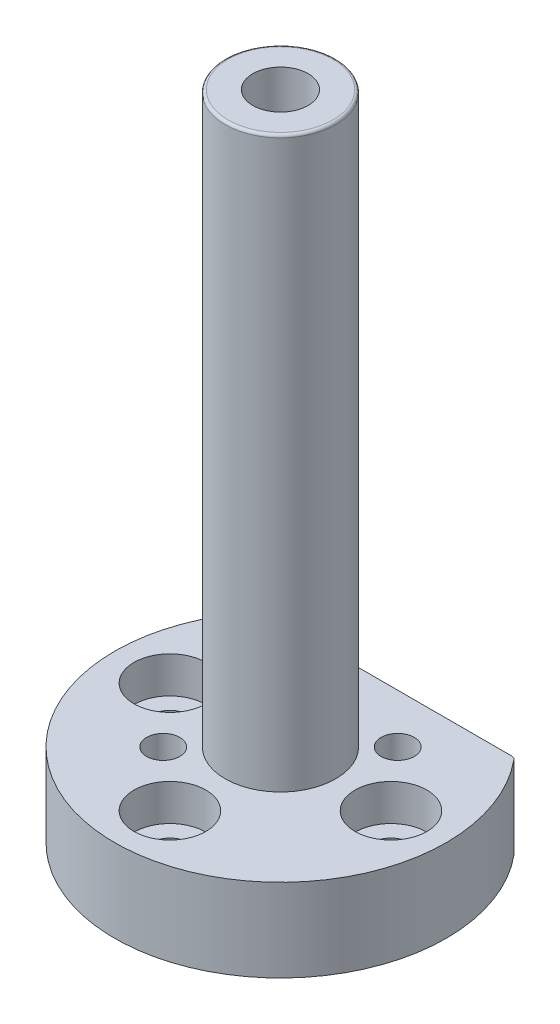
ISO-10303-21;
HEADER;
FILE_DESCRIPTION(('STEP AP214'),'2;1');
FILE_NAME('part.step','',(''),(''),'','','');
FILE_SCHEMA(('AUTOMOTIVE_DESIGN { 1 0 10303 214 1 1 1 1 }'));
ENDSEC;
DATA;
#1=APPLICATION_CONTEXT('core data for automotive mechanical design processes');
#2=APPLICATION_PROTOCOL_DEFINITION('international standard','automotive_design',2000,#1);
#3=PRODUCT_CONTEXT('',#1,'mechanical');
#4=PRODUCT('Part','Part','',(#3));
#5=PRODUCT_RELATED_PRODUCT_CATEGORY('part','',(#4));
#6=PRODUCT_DEFINITION_FORMATION('','',#4);
#7=PRODUCT_DEFINITION_CONTEXT('part definition',#1,'design');
#8=PRODUCT_DEFINITION('design','',#6,#7);
#9=PRODUCT_DEFINITION_SHAPE('','',#8);
#10=(LENGTH_UNIT() NAMED_UNIT(*) SI_UNIT(.MILLI.,.METRE.));
#11=(NAMED_UNIT(*) PLANE_ANGLE_UNIT() SI_UNIT($,.RADIAN.));
#12=(NAMED_UNIT(*) SI_UNIT($,.STERADIAN.) SOLID_ANGLE_UNIT());
#13=UNCERTAINTY_MEASURE_WITH_UNIT(LENGTH_MEASURE(1.E-05),#10,'distance_accuracy_value','');
#14=(GEOMETRIC_REPRESENTATION_CONTEXT(3) GLOBAL_UNCERTAINTY_ASSIGNED_CONTEXT((#13)) GLOBAL_UNIT_ASSIGNED_CONTEXT((#10,
#11,#12)) REPRESENTATION_CONTEXT('',''));
#15=CARTESIAN_POINT('',(0.,0.,0.));
#16=DIRECTION('',(0.,0.,1.));
#17=DIRECTION('',(1.,0.,0.));
#18=AXIS2_PLACEMENT_3D('',#15,#16,#17);
#19=CARTESIAN_POINT('',(0.,15.,0.));
#20=DIRECTION('',(0.,-1.,0.));
#21=DIRECTION('',(0.,0.,-1.));
#22=AXIS2_PLACEMENT_3D('',#19,#20,#21);
#23=CYLINDRICAL_SURFACE('',#22,30.);
#24=CARTESIAN_POINT('',(0.,15.,0.));
#25=DIRECTION('',(0.,1.,0.));
#26=DIRECTION('',(0.,0.,1.));
#27=AXIS2_PLACEMENT_3D('',#24,#25,#26);
#28=CIRCLE('',#27,30.);
#29=CARTESIAN_POINT('',(-23.1028049318558,15.,-19.1379310344828));
#30=VERTEX_POINT('',#29);
#31=CARTESIAN_POINT('',(23.1028049318558,15.,-19.1379310344828));
#32=VERTEX_POINT('',#31);
#33=EDGE_CURVE('E97',#30,#32,#28,.T.);
#34=ORIENTED_EDGE('',*,*,#33,.F.);
#35=DIRECTION('',(0.,-1.,0.));
#36=VECTOR('',#35,1.);
#37=CARTESIAN_POINT('',(-23.1028049318558,15.,-19.1379310344828));
#38=LINE('',#37,#36);
#39=CARTESIAN_POINT('',(-23.1028049318558,0.,-19.1379310344828));
#40=VERTEX_POINT('',#39);
#41=EDGE_CURVE('E84',#30,#40,#38,.T.);
#42=ORIENTED_EDGE('',*,*,#41,.T.);
#43=CARTESIAN_POINT('',(0.,0.,0.));
#44=DIRECTION('',(0.,1.,0.));
#45=DIRECTION('',(0.,0.,1.));
#46=AXIS2_PLACEMENT_3D('',#43,#44,#45);
#47=CIRCLE('',#46,30.);
#48=CARTESIAN_POINT('',(23.1028049318558,0.,-19.1379310344828));
#49=VERTEX_POINT('',#48);
#50=EDGE_CURVE('E95',#40,#49,#47,.T.);
#51=ORIENTED_EDGE('',*,*,#50,.T.);
#52=DIRECTION('',(0.,-1.,0.));
#53=VECTOR('',#52,1.);
#54=CARTESIAN_POINT('',(23.1028049318558,15.,-19.1379310344828));
#55=LINE('',#54,#53);
#56=EDGE_CURVE('E99',#49,#32,#55,.F.);
#57=ORIENTED_EDGE('',*,*,#56,.T.);
#58=EDGE_LOOP('',(#34,#42,#51,#57));
#59=FACE_BOUND('',#58,.T.);
#60=ADVANCED_FACE('F39',(#59),#23,.T.);
#61=CARTESIAN_POINT('',(22.798026230356,15.,-19.5));
#62=DIRECTION('',(0.,0.,1.));
#63=DIRECTION('',(1.,0.,0.));
#64=AXIS2_PLACEMENT_3D('',#61,#62,#63);
#65=PLANE('',#64);
#66=DIRECTION('',(-1.,0.,0.));
#67=VECTOR('',#66,1.);
#68=CARTESIAN_POINT('',(22.798026230356,0.,-19.5));
#69=LINE('',#68,#67);
#70=CARTESIAN_POINT('',(22.3327114341273,0.,-19.5));
#71=VERTEX_POINT('',#70);
#72=CARTESIAN_POINT('',(-22.3327114341273,0.,-19.5));
#73=VERTEX_POINT('',#72);
#74=EDGE_CURVE('E103',#71,#73,#69,.T.);
#75=ORIENTED_EDGE('',*,*,#74,.T.);
#76=DIRECTION('',(0.,-1.,0.));
#77=VECTOR('',#76,1.);
#78=CARTESIAN_POINT('',(-22.3327114341273,15.,-19.5));
#79=LINE('',#78,#77);
#80=CARTESIAN_POINT('',(-22.3327114341273,15.,-19.5));
#81=VERTEX_POINT('',#80);
#82=EDGE_CURVE('E55',#73,#81,#79,.F.);
#83=ORIENTED_EDGE('',*,*,#82,.T.);
#84=DIRECTION('',(-1.,0.,0.));
#85=VECTOR('',#84,1.);
#86=CARTESIAN_POINT('',(22.798026230356,15.,-19.5));
#87=LINE('',#86,#85);
#88=CARTESIAN_POINT('',(22.3327114341273,15.,-19.5));
#89=VERTEX_POINT('',#88);
#90=EDGE_CURVE('E113',#89,#81,#87,.T.);
#91=ORIENTED_EDGE('',*,*,#90,.F.);
#92=DIRECTION('',(0.,-1.,0.));
#93=VECTOR('',#92,1.);
#94=CARTESIAN_POINT('',(22.3327114341273,15.,-19.5));
#95=LINE('',#94,#93);
#96=EDGE_CURVE('E89',#89,#71,#95,.T.);
#97=ORIENTED_EDGE('',*,*,#96,.T.);
#98=EDGE_LOOP('',(#75,#83,#91,#97));
#99=FACE_BOUND('',#98,.T.);
#100=ADVANCED_FACE('F228',(#99),#65,.F.);
#101=CARTESIAN_POINT('',(0.,15.,0.));
#102=DIRECTION('',(0.,1.,0.));
#103=DIRECTION('',(0.,0.,1.));
#104=AXIS2_PLACEMENT_3D('',#101,#102,#103);
#105=PLANE('',#104);
#106=CARTESIAN_POINT('',(-10.6066017177983,15.,10.6066017177982));
#107=DIRECTION('',(0.,1.,0.));
#108=DIRECTION('',(0.,0.,1.));
#109=AXIS2_PLACEMENT_3D('',#106,#107,#108);
#110=CIRCLE('',#109,3.);
#111=CARTESIAN_POINT('',(-10.6066017177983,15.,13.6066017177982));
#112=VERTEX_POINT('',#111);
#113=EDGE_CURVE('E208',#112,#112,#110,.T.);
#114=ORIENTED_EDGE('',*,*,#113,.F.);
#115=EDGE_LOOP('',(#114));
#116=FACE_BOUND('',#115,.T.);
#117=CARTESIAN_POINT('',(10.6066017177983,15.,-10.6066017177982));
#118=DIRECTION('',(0.,1.,0.));
#119=DIRECTION('',(0.,0.,1.));
#120=AXIS2_PLACEMENT_3D('',#117,#118,#119);
#121=CIRCLE('',#120,3.);
#122=CARTESIAN_POINT('',(10.6066017177983,15.,-7.60660171779815));
#123=VERTEX_POINT('',#122);
#124=EDGE_CURVE('E200',#123,#123,#121,.T.);
#125=ORIENTED_EDGE('',*,*,#124,.F.);
#126=EDGE_LOOP('',(#125));
#127=FACE_BOUND('',#126,.T.);
#128=CARTESIAN_POINT('',(-20.,15.,0.));
#129=DIRECTION('',(0.,1.,0.));
#130=DIRECTION('',(-1.,0.,0.));
#131=AXIS2_PLACEMENT_3D('',#128,#129,#130);
#132=CIRCLE('',#131,6.5);
#133=CARTESIAN_POINT('',(-26.5,15.,0.));
#134=VERTEX_POINT('',#133);
#135=EDGE_CURVE('E193',#134,#134,#132,.T.);
#136=ORIENTED_EDGE('',*,*,#135,.F.);
#137=EDGE_LOOP('',(#136));
#138=FACE_BOUND('',#137,.T.);
#139=CARTESIAN_POINT('',(20.,15.,2.09488880330588E-13));
#140=DIRECTION('',(0.,1.,0.));
#141=DIRECTION('',(1.,0.,0.));
#142=AXIS2_PLACEMENT_3D('',#139,#140,#141);
#143=CIRCLE('',#142,6.5);
#144=CARTESIAN_POINT('',(26.5,15.,2.77572766438029E-13));
#145=VERTEX_POINT('',#144);
#146=EDGE_CURVE('E177',#145,#145,#143,.T.);
#147=ORIENTED_EDGE('',*,*,#146,.F.);
#148=EDGE_LOOP('',(#147));
#149=FACE_BOUND('',#148,.T.);
#150=CARTESIAN_POINT('',(0.,15.,20.));
#151=DIRECTION('',(0.,1.,0.));
#152=DIRECTION('',(0.,0.,1.));
#153=AXIS2_PLACEMENT_3D('',#150,#151,#152);
#154=CIRCLE('',#153,6.5);
#155=CARTESIAN_POINT('',(0.,15.,26.5));
#156=VERTEX_POINT('',#155);
#157=EDGE_CURVE('E152',#156,#156,#154,.T.);
#158=ORIENTED_EDGE('',*,*,#157,.F.);
#159=EDGE_LOOP('',(#158));
#160=FACE_BOUND('',#159,.T.);
#161=CARTESIAN_POINT('',(0.,15.,0.));
#162=DIRECTION('',(0.,1.,0.));
#163=DIRECTION('',(0.,0.,1.));
#164=AXIS2_PLACEMENT_3D('',#161,#162,#163);
#165=CIRCLE('',#164,10.);
#166=CARTESIAN_POINT('',(0.,15.,10.));
#167=VERTEX_POINT('',#166);
#168=EDGE_CURVE('E121',#167,#167,#165,.T.);
#169=ORIENTED_EDGE('',*,*,#168,.F.);
#170=EDGE_LOOP('',(#169));
#171=FACE_BOUND('',#170,.T.);
#172=ORIENTED_EDGE('',*,*,#90,.T.);
#173=CARTESIAN_POINT('',(-22.3327114341273,15.,-18.5));
#174=DIRECTION('',(0.,1.,0.));
#175=DIRECTION('',(0.,0.,1.));
#176=AXIS2_PLACEMENT_3D('',#173,#174,#175);
#177=CIRCLE('',#176,1.);
#178=EDGE_CURVE('E11',#81,#30,#177,.T.);
#179=ORIENTED_EDGE('',*,*,#178,.T.);
#180=ORIENTED_EDGE('',*,*,#33,.T.);
#181=CARTESIAN_POINT('',(22.3327114341273,15.,-18.5));
#182=DIRECTION('',(0.,1.,0.));
#183=DIRECTION('',(0.,0.,1.));
#184=AXIS2_PLACEMENT_3D('',#181,#182,#183);
#185=CIRCLE('',#184,1.);
#186=EDGE_CURVE('E48',#32,#89,#185,.T.);
#187=ORIENTED_EDGE('',*,*,#186,.T.);
#188=EDGE_LOOP('',(#172,#179,#180,#187));
#189=FACE_BOUND('',#188,.T.);
#190=ADVANCED_FACE('F225',(#116,#127,#138,#149,#160,#171,#189),#105,.T.);
#191=CARTESIAN_POINT('',(0.,0.,0.));
#192=DIRECTION('',(0.,1.,0.));
#193=DIRECTION('',(0.,0.,1.));
#194=AXIS2_PLACEMENT_3D('',#191,#192,#193);
#195=PLANE('',#194);
#196=CARTESIAN_POINT('',(-10.6066017177983,0.,10.6066017177982));
#197=DIRECTION('',(0.,1.,0.));
#198=DIRECTION('',(0.,0.,1.));
#199=AXIS2_PLACEMENT_3D('',#196,#197,#198);
#200=CIRCLE('',#199,3.);
#201=CARTESIAN_POINT('',(-10.6066017177983,0.,13.6066017177982));
#202=VERTEX_POINT('',#201);
#203=EDGE_CURVE('E185',#202,#202,#200,.T.);
#204=ORIENTED_EDGE('',*,*,#203,.T.);
#205=EDGE_LOOP('',(#204));
#206=FACE_BOUND('',#205,.T.);
#207=CARTESIAN_POINT('',(10.6066017177983,0.,-10.6066017177982));
#208=DIRECTION('',(0.,1.,0.));
#209=DIRECTION('',(0.,0.,1.));
#210=AXIS2_PLACEMENT_3D('',#207,#208,#209);
#211=CIRCLE('',#210,3.);
#212=CARTESIAN_POINT('',(10.6066017177983,0.,-7.60660171779815));
#213=VERTEX_POINT('',#212);
#214=EDGE_CURVE('E204',#213,#213,#211,.T.);
#215=ORIENTED_EDGE('',*,*,#214,.T.);
#216=EDGE_LOOP('',(#215));
#217=FACE_BOUND('',#216,.T.);
#218=CARTESIAN_POINT('',(-20.,0.,0.));
#219=DIRECTION('',(0.,1.,0.));
#220=DIRECTION('',(-1.,0.,0.));
#221=AXIS2_PLACEMENT_3D('',#218,#219,#220);
#222=CIRCLE('',#221,3.3);
#223=CARTESIAN_POINT('',(-23.3,0.,0.));
#224=VERTEX_POINT('',#223);
#225=EDGE_CURVE('E172',#224,#224,#222,.T.);
#226=ORIENTED_EDGE('',*,*,#225,.T.);
#227=EDGE_LOOP('',(#226));
#228=FACE_BOUND('',#227,.T.);
#229=CARTESIAN_POINT('',(20.,0.,2.09488880330588E-13));
#230=DIRECTION('',(0.,1.,0.));
#231=DIRECTION('',(1.,0.,0.));
#232=AXIS2_PLACEMENT_3D('',#229,#230,#231);
#233=CIRCLE('',#232,3.3);
#234=CARTESIAN_POINT('',(23.3,0.,2.44054545585135E-13));
#235=VERTEX_POINT('',#234);
#236=EDGE_CURVE('E181',#235,#235,#233,.T.);
#237=ORIENTED_EDGE('',*,*,#236,.T.);
#238=EDGE_LOOP('',(#237));
#239=FACE_BOUND('',#238,.T.);
#240=CARTESIAN_POINT('',(0.,0.,20.));
#241=DIRECTION('',(0.,1.,0.));
#242=DIRECTION('',(0.,0.,1.));
#243=AXIS2_PLACEMENT_3D('',#240,#241,#242);
#244=CIRCLE('',#243,3.3);
#245=CARTESIAN_POINT('',(0.,0.,23.3));
#246=VERTEX_POINT('',#245);
#247=EDGE_CURVE('E156',#246,#246,#244,.T.);
#248=ORIENTED_EDGE('',*,*,#247,.T.);
#249=EDGE_LOOP('',(#248));
#250=FACE_BOUND('',#249,.T.);
#251=CARTESIAN_POINT('',(0.,0.,0.));
#252=DIRECTION('',(0.,-1.,0.));
#253=DIRECTION('',(0.,0.,-1.));
#254=AXIS2_PLACEMENT_3D('',#251,#252,#253);
#255=CIRCLE('',#254,7.25);
#256=CARTESIAN_POINT('',(0.,0.,-7.25));
#257=VERTEX_POINT('',#256);
#258=EDGE_CURVE('E110',#257,#257,#255,.T.);
#259=ORIENTED_EDGE('',*,*,#258,.F.);
#260=EDGE_LOOP('',(#259));
#261=FACE_BOUND('',#260,.T.);
#262=ORIENTED_EDGE('',*,*,#50,.F.);
#263=CARTESIAN_POINT('',(-22.3327114341273,0.,-18.5));
#264=DIRECTION('',(0.,1.,0.));
#265=DIRECTION('',(0.,0.,1.));
#266=AXIS2_PLACEMENT_3D('',#263,#264,#265);
#267=CIRCLE('',#266,1.);
#268=EDGE_CURVE('E80',#40,#73,#267,.F.);
#269=ORIENTED_EDGE('',*,*,#268,.T.);
#270=ORIENTED_EDGE('',*,*,#74,.F.);
#271=CARTESIAN_POINT('',(22.3327114341273,0.,-18.5));
#272=DIRECTION('',(0.,1.,0.));
#273=DIRECTION('',(0.,0.,1.));
#274=AXIS2_PLACEMENT_3D('',#271,#272,#273);
#275=CIRCLE('',#274,1.);
#276=EDGE_CURVE('E90',#71,#49,#275,.F.);
#277=ORIENTED_EDGE('',*,*,#276,.T.);
#278=EDGE_LOOP('',(#262,#269,#270,#277));
#279=FACE_BOUND('',#278,.T.);
#280=ADVANCED_FACE('F101',(#206,#217,#228,#239,#250,#261,#279),#195,.F.);
#281=CARTESIAN_POINT('',(0.,118.,0.));
#282=DIRECTION('',(0.,-1.,0.));
#283=DIRECTION('',(0.,0.,-1.));
#284=AXIS2_PLACEMENT_3D('',#281,#282,#283);
#285=CYLINDRICAL_SURFACE('',#284,10.);
#286=CARTESIAN_POINT('',(0.,117.5,0.));
#287=DIRECTION('',(0.,1.,0.));
#288=DIRECTION('',(0.,0.,1.));
#289=AXIS2_PLACEMENT_3D('',#286,#287,#288);
#290=CIRCLE('',#289,10.);
#291=CARTESIAN_POINT('',(0.,117.5,10.));
#292=VERTEX_POINT('',#291);
#293=EDGE_CURVE('E120',#292,#292,#290,.F.);
#294=ORIENTED_EDGE('',*,*,#293,.T.);
#295=EDGE_LOOP('',(#294));
#296=FACE_BOUND('',#295,.T.);
#297=ORIENTED_EDGE('',*,*,#168,.T.);
#298=EDGE_LOOP('',(#297));
#299=FACE_BOUND('',#298,.T.);
#300=ADVANCED_FACE('F274',(#296,#299),#285,.T.);
#301=CARTESIAN_POINT('',(0.,118.,0.));
#302=DIRECTION('',(0.,1.,0.));
#303=DIRECTION('',(0.,0.,1.));
#304=AXIS2_PLACEMENT_3D('',#301,#302,#303);
#305=PLANE('',#304);
#306=CARTESIAN_POINT('',(0.,118.,0.));
#307=DIRECTION('',(0.,1.,0.));
#308=DIRECTION('',(0.,0.,1.));
#309=AXIS2_PLACEMENT_3D('',#306,#307,#308);
#310=CIRCLE('',#309,9.5);
#311=CARTESIAN_POINT('',(0.,118.,9.5));
#312=VERTEX_POINT('',#311);
#313=EDGE_CURVE('E116',#312,#312,#310,.T.);
#314=ORIENTED_EDGE('',*,*,#313,.T.);
#315=EDGE_LOOP('',(#314));
#316=FACE_BOUND('',#315,.T.);
#317=CARTESIAN_POINT('',(0.,118.,0.));
#318=DIRECTION('',(0.,-1.,0.));
#319=DIRECTION('',(0.,0.,-1.));
#320=AXIS2_PLACEMENT_3D('',#317,#318,#319);
#321=CIRCLE('',#320,5.);
#322=CARTESIAN_POINT('',(0.,118.,-5.));
#323=VERTEX_POINT('',#322);
#324=EDGE_CURVE('E142',#323,#323,#321,.T.);
#325=ORIENTED_EDGE('',*,*,#324,.T.);
#326=EDGE_LOOP('',(#325));
#327=FACE_BOUND('',#326,.T.);
#328=ADVANCED_FACE('F270',(#316,#327),#305,.T.);
#329=CARTESIAN_POINT('',(0.,57.,0.));
#330=DIRECTION('',(0.,-1.,0.));
#331=DIRECTION('',(0.,0.,-1.));
#332=AXIS2_PLACEMENT_3D('',#329,#330,#331);
#333=CYLINDRICAL_SURFACE('',#332,7.25);
#334=CARTESIAN_POINT('',(0.,57.,0.));
#335=DIRECTION('',(0.,-1.,0.));
#336=DIRECTION('',(0.,0.,-1.));
#337=AXIS2_PLACEMENT_3D('',#334,#335,#336);
#338=CIRCLE('',#337,7.25);
#339=CARTESIAN_POINT('',(0.,57.,-7.25));
#340=VERTEX_POINT('',#339);
#341=EDGE_CURVE('E104',#340,#340,#338,.T.);
#342=ORIENTED_EDGE('',*,*,#341,.F.);
#343=EDGE_LOOP('',(#342));
#344=FACE_BOUND('',#343,.T.);
#345=ORIENTED_EDGE('',*,*,#258,.T.);
#346=EDGE_LOOP('',(#345));
#347=FACE_BOUND('',#346,.T.);
#348=ADVANCED_FACE('F273',(#344,#347),#333,.F.);
#349=CARTESIAN_POINT('',(0.,57.,0.));
#350=DIRECTION('',(0.,-1.,0.));
#351=DIRECTION('',(0.,0.,-1.));
#352=AXIS2_PLACEMENT_3D('',#349,#350,#351);
#353=PLANE('',#352);
#354=CARTESIAN_POINT('',(0.,57.,0.));
#355=DIRECTION('',(0.,-1.,0.));
#356=DIRECTION('',(0.,0.,-1.));
#357=AXIS2_PLACEMENT_3D('',#354,#355,#356);
#358=CIRCLE('',#357,5.);
#359=CARTESIAN_POINT('',(0.,57.,-5.));
#360=VERTEX_POINT('',#359);
#361=EDGE_CURVE('E144',#360,#360,#358,.T.);
#362=ORIENTED_EDGE('',*,*,#361,.F.);
#363=EDGE_LOOP('',(#362));
#364=FACE_BOUND('',#363,.T.);
#365=ORIENTED_EDGE('',*,*,#341,.T.);
#366=EDGE_LOOP('',(#365));
#367=FACE_BOUND('',#366,.T.);
#368=ADVANCED_FACE('F282',(#364,#367),#353,.T.);
#369=CARTESIAN_POINT('',(0.,118.,0.));
#370=DIRECTION('',(0.,-1.,0.));
#371=DIRECTION('',(0.,0.,-1.));
#372=AXIS2_PLACEMENT_3D('',#369,#370,#371);
#373=CYLINDRICAL_SURFACE('',#372,5.);
#374=ORIENTED_EDGE('',*,*,#324,.F.);
#375=EDGE_LOOP('',(#374));
#376=FACE_BOUND('',#375,.T.);
#377=ORIENTED_EDGE('',*,*,#361,.T.);
#378=EDGE_LOOP('',(#377));
#379=FACE_BOUND('',#378,.T.);
#380=ADVANCED_FACE('F278',(#376,#379),#373,.F.);
#381=CARTESIAN_POINT('',(0.,8.4,20.));
#382=DIRECTION('',(0.,1.,0.));
#383=DIRECTION('',(0.,0.,1.));
#384=AXIS2_PLACEMENT_3D('',#381,#382,#383);
#385=CYLINDRICAL_SURFACE('',#384,6.5);
#386=CARTESIAN_POINT('',(0.,8.4,20.));
#387=DIRECTION('',(0.,1.,0.));
#388=DIRECTION('',(0.,0.,1.));
#389=AXIS2_PLACEMENT_3D('',#386,#387,#388);
#390=CIRCLE('',#389,6.5);
#391=CARTESIAN_POINT('',(0.,8.4,26.5));
#392=VERTEX_POINT('',#391);
#393=EDGE_CURVE('E148',#392,#392,#390,.T.);
#394=ORIENTED_EDGE('',*,*,#393,.F.);
#395=EDGE_LOOP('',(#394));
#396=FACE_BOUND('',#395,.T.);
#397=ORIENTED_EDGE('',*,*,#157,.T.);
#398=EDGE_LOOP('',(#397));
#399=FACE_BOUND('',#398,.T.);
#400=ADVANCED_FACE('F281',(#396,#399),#385,.F.);
#401=CARTESIAN_POINT('',(0.,8.4,20.));
#402=DIRECTION('',(0.,1.,0.));
#403=DIRECTION('',(0.,0.,1.));
#404=AXIS2_PLACEMENT_3D('',#401,#402,#403);
#405=PLANE('',#404);
#406=CARTESIAN_POINT('',(0.,8.4,20.));
#407=DIRECTION('',(0.,1.,0.));
#408=DIRECTION('',(0.,0.,1.));
#409=AXIS2_PLACEMENT_3D('',#406,#407,#408);
#410=CIRCLE('',#409,3.3);
#411=CARTESIAN_POINT('',(0.,8.4,23.3));
#412=VERTEX_POINT('',#411);
#413=EDGE_CURVE('E160',#412,#412,#410,.T.);
#414=ORIENTED_EDGE('',*,*,#413,.F.);
#415=EDGE_LOOP('',(#414));
#416=FACE_BOUND('',#415,.T.);
#417=ORIENTED_EDGE('',*,*,#393,.T.);
#418=EDGE_LOOP('',(#417));
#419=FACE_BOUND('',#418,.T.);
#420=ADVANCED_FACE('F305',(#416,#419),#405,.T.);
#421=CARTESIAN_POINT('',(0.,0.,20.));
#422=DIRECTION('',(0.,1.,0.));
#423=DIRECTION('',(0.,0.,1.));
#424=AXIS2_PLACEMENT_3D('',#421,#422,#423);
#425=CYLINDRICAL_SURFACE('',#424,3.3);
#426=ORIENTED_EDGE('',*,*,#247,.F.);
#427=EDGE_LOOP('',(#426));
#428=FACE_BOUND('',#427,.T.);
#429=ORIENTED_EDGE('',*,*,#413,.T.);
#430=EDGE_LOOP('',(#429));
#431=FACE_BOUND('',#430,.T.);
#432=ADVANCED_FACE('F309',(#428,#431),#425,.F.);
#433=CARTESIAN_POINT('',(20.,8.4,2.09488880330588E-13));
#434=DIRECTION('',(0.,1.,0.));
#435=DIRECTION('',(1.,0.,0.));
#436=AXIS2_PLACEMENT_3D('',#433,#434,#435);
#437=CYLINDRICAL_SURFACE('',#436,6.5);
#438=CARTESIAN_POINT('',(20.,8.4,2.09488880330588E-13));
#439=DIRECTION('',(0.,1.,0.));
#440=DIRECTION('',(1.,0.,0.));
#441=AXIS2_PLACEMENT_3D('',#438,#439,#440);
#442=CIRCLE('',#441,6.5);
#443=CARTESIAN_POINT('',(26.5,8.4,2.77572766438029E-13));
#444=VERTEX_POINT('',#443);
#445=EDGE_CURVE('E168',#444,#444,#442,.T.);
#446=ORIENTED_EDGE('',*,*,#445,.F.);
#447=EDGE_LOOP('',(#446));
#448=FACE_BOUND('',#447,.T.);
#449=ORIENTED_EDGE('',*,*,#146,.T.);
#450=EDGE_LOOP('',(#449));
#451=FACE_BOUND('',#450,.T.);
#452=ADVANCED_FACE('F313',(#448,#451),#437,.F.);
#453=CARTESIAN_POINT('',(20.,8.4,2.09488880330588E-13));
#454=DIRECTION('',(0.,1.,0.));
#455=DIRECTION('',(1.,0.,0.));
#456=AXIS2_PLACEMENT_3D('',#453,#454,#455);
#457=PLANE('',#456);
#458=CARTESIAN_POINT('',(20.,8.4,2.09488880330588E-13));
#459=DIRECTION('',(0.,1.,0.));
#460=DIRECTION('',(1.,0.,0.));
#461=AXIS2_PLACEMENT_3D('',#458,#459,#460);
#462=CIRCLE('',#461,3.3);
#463=CARTESIAN_POINT('',(23.3,8.4,2.44054545585135E-13));
#464=VERTEX_POINT('',#463);
#465=EDGE_CURVE('E173',#464,#464,#462,.T.);
#466=ORIENTED_EDGE('',*,*,#465,.F.);
#467=EDGE_LOOP('',(#466));
#468=FACE_BOUND('',#467,.T.);
#469=ORIENTED_EDGE('',*,*,#445,.T.);
#470=EDGE_LOOP('',(#469));
#471=FACE_BOUND('',#470,.T.);
#472=ADVANCED_FACE('F317',(#468,#471),#457,.T.);
#473=CARTESIAN_POINT('',(20.,0.,2.09488880330588E-13));
#474=DIRECTION('',(0.,1.,0.));
#475=DIRECTION('',(1.,0.,0.));
#476=AXIS2_PLACEMENT_3D('',#473,#474,#475);
#477=CYLINDRICAL_SURFACE('',#476,3.3);
#478=ORIENTED_EDGE('',*,*,#236,.F.);
#479=EDGE_LOOP('',(#478));
#480=FACE_BOUND('',#479,.T.);
#481=ORIENTED_EDGE('',*,*,#465,.T.);
#482=EDGE_LOOP('',(#481));
#483=FACE_BOUND('',#482,.T.);
#484=ADVANCED_FACE('F321',(#480,#483),#477,.F.);
#485=CARTESIAN_POINT('',(-20.,8.4,0.));
#486=DIRECTION('',(0.,1.,0.));
#487=DIRECTION('',(-1.,0.,0.));
#488=AXIS2_PLACEMENT_3D('',#485,#486,#487);
#489=CYLINDRICAL_SURFACE('',#488,6.5);
#490=CARTESIAN_POINT('',(-20.,8.4,0.));
#491=DIRECTION('',(0.,1.,0.));
#492=DIRECTION('',(-1.,0.,0.));
#493=AXIS2_PLACEMENT_3D('',#490,#491,#492);
#494=CIRCLE('',#493,6.5);
#495=CARTESIAN_POINT('',(-26.5,8.4,0.));
#496=VERTEX_POINT('',#495);
#497=EDGE_CURVE('E164',#496,#496,#494,.T.);
#498=ORIENTED_EDGE('',*,*,#497,.F.);
#499=EDGE_LOOP('',(#498));
#500=FACE_BOUND('',#499,.T.);
#501=ORIENTED_EDGE('',*,*,#135,.T.);
#502=EDGE_LOOP('',(#501));
#503=FACE_BOUND('',#502,.T.);
#504=ADVANCED_FACE('F325',(#500,#503),#489,.F.);
#505=CARTESIAN_POINT('',(-20.,8.4,0.));
#506=DIRECTION('',(0.,1.,0.));
#507=DIRECTION('',(-1.,0.,0.));
#508=AXIS2_PLACEMENT_3D('',#505,#506,#507);
#509=PLANE('',#508);
#510=CARTESIAN_POINT('',(-20.,8.4,0.));
#511=DIRECTION('',(0.,1.,0.));
#512=DIRECTION('',(-1.,0.,0.));
#513=AXIS2_PLACEMENT_3D('',#510,#511,#512);
#514=CIRCLE('',#513,3.3);
#515=CARTESIAN_POINT('',(-23.3,8.4,0.));
#516=VERTEX_POINT('',#515);
#517=EDGE_CURVE('E189',#516,#516,#514,.T.);
#518=ORIENTED_EDGE('',*,*,#517,.F.);
#519=EDGE_LOOP('',(#518));
#520=FACE_BOUND('',#519,.T.);
#521=ORIENTED_EDGE('',*,*,#497,.T.);
#522=EDGE_LOOP('',(#521));
#523=FACE_BOUND('',#522,.T.);
#524=ADVANCED_FACE('F263',(#520,#523),#509,.T.);
#525=CARTESIAN_POINT('',(-20.,0.,0.));
#526=DIRECTION('',(0.,1.,0.));
#527=DIRECTION('',(-1.,0.,0.));
#528=AXIS2_PLACEMENT_3D('',#525,#526,#527);
#529=CYLINDRICAL_SURFACE('',#528,3.3);
#530=ORIENTED_EDGE('',*,*,#225,.F.);
#531=EDGE_LOOP('',(#530));
#532=FACE_BOUND('',#531,.T.);
#533=ORIENTED_EDGE('',*,*,#517,.T.);
#534=EDGE_LOOP('',(#533));
#535=FACE_BOUND('',#534,.T.);
#536=ADVANCED_FACE('F258',(#532,#535),#529,.F.);
#537=CARTESIAN_POINT('',(0.,117.5,0.));
#538=DIRECTION('',(0.,1.,0.));
#539=DIRECTION('',(0.,0.,1.));
#540=AXIS2_PLACEMENT_3D('',#537,#538,#539);
#541=TOROIDAL_SURFACE('',#540,9.5,0.5);
#542=ORIENTED_EDGE('',*,*,#293,.F.);
#543=EDGE_LOOP('',(#542));
#544=FACE_BOUND('',#543,.T.);
#545=ORIENTED_EDGE('',*,*,#313,.F.);
#546=EDGE_LOOP('',(#545));
#547=FACE_BOUND('',#546,.T.);
#548=ADVANCED_FACE('F248',(#544,#547),#541,.T.);
#549=CARTESIAN_POINT('',(-22.3327114341273,15.,-18.5));
#550=DIRECTION('',(0.,-1.,0.));
#551=DIRECTION('',(0.,0.,-1.));
#552=AXIS2_PLACEMENT_3D('',#549,#550,#551);
#553=CYLINDRICAL_SURFACE('',#552,1.);
#554=ORIENTED_EDGE('',*,*,#178,.F.);
#555=ORIENTED_EDGE('',*,*,#82,.F.);
#556=ORIENTED_EDGE('',*,*,#268,.F.);
#557=ORIENTED_EDGE('',*,*,#41,.F.);
#558=EDGE_LOOP('',(#554,#555,#556,#557));
#559=FACE_BOUND('',#558,.T.);
#560=ADVANCED_FACE('F83',(#559),#553,.T.);
#561=CARTESIAN_POINT('',(22.3327114341273,15.,-18.5));
#562=DIRECTION('',(0.,-1.,0.));
#563=DIRECTION('',(0.,0.,-1.));
#564=AXIS2_PLACEMENT_3D('',#561,#562,#563);
#565=CYLINDRICAL_SURFACE('',#564,1.);
#566=ORIENTED_EDGE('',*,*,#186,.F.);
#567=ORIENTED_EDGE('',*,*,#56,.F.);
#568=ORIENTED_EDGE('',*,*,#276,.F.);
#569=ORIENTED_EDGE('',*,*,#96,.F.);
#570=EDGE_LOOP('',(#566,#567,#568,#569));
#571=FACE_BOUND('',#570,.T.);
#572=ADVANCED_FACE('F41',(#571),#565,.T.);
#573=CARTESIAN_POINT('',(10.6066017177983,0.,-10.6066017177982));
#574=DIRECTION('',(0.,1.,0.));
#575=DIRECTION('',(0.,0.,1.));
#576=AXIS2_PLACEMENT_3D('',#573,#574,#575);
#577=CYLINDRICAL_SURFACE('',#576,3.);
#578=ORIENTED_EDGE('',*,*,#214,.F.);
#579=EDGE_LOOP('',(#578));
#580=FACE_BOUND('',#579,.T.);
#581=ORIENTED_EDGE('',*,*,#124,.T.);
#582=EDGE_LOOP('',(#581));
#583=FACE_BOUND('',#582,.T.);
#584=ADVANCED_FACE('F221',(#580,#583),#577,.F.);
#585=CARTESIAN_POINT('',(-10.6066017177983,0.,10.6066017177982));
#586=DIRECTION('',(0.,1.,0.));
#587=DIRECTION('',(0.,0.,1.));
#588=AXIS2_PLACEMENT_3D('',#585,#586,#587);
#589=CYLINDRICAL_SURFACE('',#588,3.);
#590=ORIENTED_EDGE('',*,*,#203,.F.);
#591=EDGE_LOOP('',(#590));
#592=FACE_BOUND('',#591,.T.);
#593=ORIENTED_EDGE('',*,*,#113,.T.);
#594=EDGE_LOOP('',(#593));
#595=FACE_BOUND('',#594,.T.);
#596=ADVANCED_FACE('F218',(#592,#595),#589,.F.);
#597=CLOSED_SHELL('',(#60,#100,#190,#280,#300,#328,#348,#368,#380,#400,#420,#432,#452,#472,#484,
#504,#524,#536,#548,#560,#572,#584,#596));
#598=MANIFOLD_SOLID_BREP('B2',#597);
#599=ADVANCED_BREP_SHAPE_REPRESENTATION('',(#18,#598),#14);
#600=SHAPE_DEFINITION_REPRESENTATION(#9,#599);
ENDSEC;
END-ISO-10303-21;
